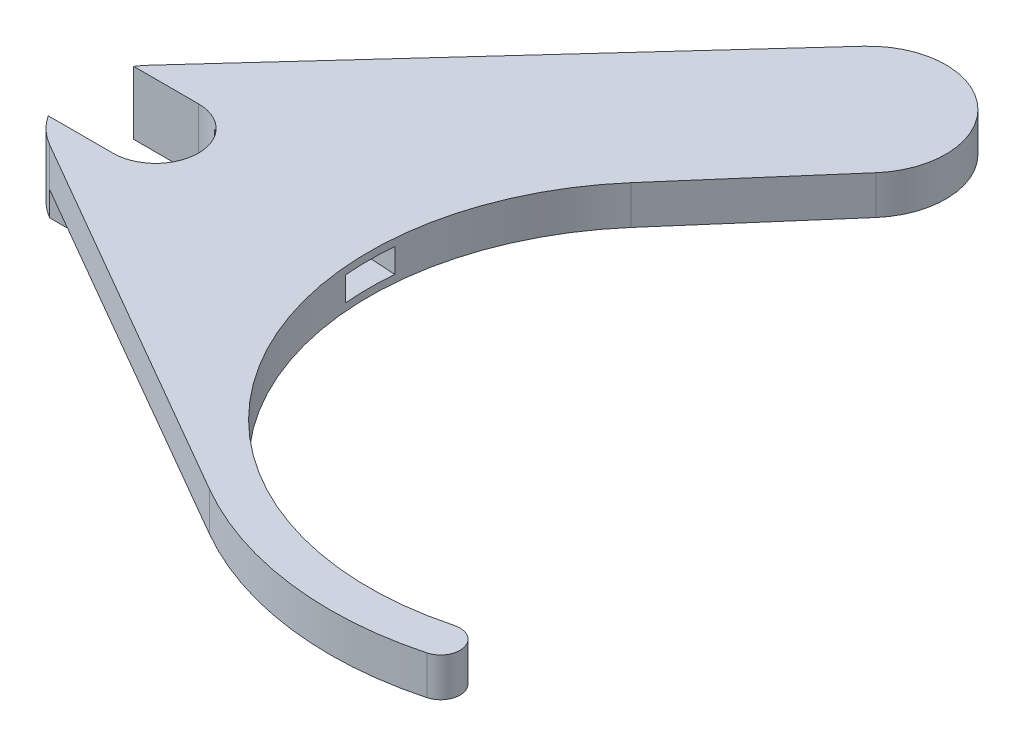
ISO-10303-21;
HEADER;
FILE_DESCRIPTION(('STEP AP214'),'2;1');
FILE_NAME('part.step','',(''),(''),'','','');
FILE_SCHEMA(('AUTOMOTIVE_DESIGN { 1 0 10303 214 1 1 1 1 }'));
ENDSEC;
DATA;
#1=APPLICATION_CONTEXT('core data for automotive mechanical design processes');
#2=APPLICATION_PROTOCOL_DEFINITION('international standard','automotive_design',2000,#1);
#3=PRODUCT_CONTEXT('',#1,'mechanical');
#4=PRODUCT('Part','Part','',(#3));
#5=PRODUCT_RELATED_PRODUCT_CATEGORY('part','',(#4));
#6=PRODUCT_DEFINITION_FORMATION('','',#4);
#7=PRODUCT_DEFINITION_CONTEXT('part definition',#1,'design');
#8=PRODUCT_DEFINITION('design','',#6,#7);
#9=PRODUCT_DEFINITION_SHAPE('','',#8);
#10=(LENGTH_UNIT() NAMED_UNIT(*) SI_UNIT(.MILLI.,.METRE.));
#11=(NAMED_UNIT(*) PLANE_ANGLE_UNIT() SI_UNIT($,.RADIAN.));
#12=(NAMED_UNIT(*) SI_UNIT($,.STERADIAN.) SOLID_ANGLE_UNIT());
#13=UNCERTAINTY_MEASURE_WITH_UNIT(LENGTH_MEASURE(1.E-05),#10,'distance_accuracy_value','');
#14=(GEOMETRIC_REPRESENTATION_CONTEXT(3) GLOBAL_UNCERTAINTY_ASSIGNED_CONTEXT((#13)) GLOBAL_UNIT_ASSIGNED_CONTEXT((#10,
#11,#12)) REPRESENTATION_CONTEXT('',''));
#15=CARTESIAN_POINT('',(0.,0.,0.));
#16=DIRECTION('',(0.,0.,1.));
#17=DIRECTION('',(1.,0.,0.));
#18=AXIS2_PLACEMENT_3D('',#15,#16,#17);
#19=CARTESIAN_POINT('',(0.,4.7625,0.));
#20=DIRECTION('',(0.,-1.,0.));
#21=DIRECTION('',(0.,0.,-1.));
#22=AXIS2_PLACEMENT_3D('',#19,#20,#21);
#23=CYLINDRICAL_SURFACE('',#22,6.35);
#24=CARTESIAN_POINT('',(0.,3.96875,0.));
#25=DIRECTION('',(0.,-1.,0.));
#26=DIRECTION('',(0.,0.,-1.));
#27=AXIS2_PLACEMENT_3D('',#24,#25,#26);
#28=CIRCLE('',#27,6.35);
#29=CARTESIAN_POINT('',(-3.175,3.96875,5.49926131403119));
#30=VERTEX_POINT('',#29);
#31=CARTESIAN_POINT('',(-5.29834503406182,3.96875,3.5000057));
#32=VERTEX_POINT('',#31);
#33=EDGE_CURVE('E185',#30,#32,#28,.T.);
#34=ORIENTED_EDGE('',*,*,#33,.T.);
#35=DIRECTION('',(0.,-1.,0.));
#36=VECTOR('',#35,1.);
#37=CARTESIAN_POINT('',(-5.29834503406182,16.8464882443737,3.5000057));
#38=LINE('',#37,#36);
#39=CARTESIAN_POINT('',(-5.29834503406182,-1.20625,3.5000057));
#40=VERTEX_POINT('',#39);
#41=EDGE_CURVE('E180',#32,#40,#38,.T.);
#42=ORIENTED_EDGE('',*,*,#41,.T.);
#43=CARTESIAN_POINT('',(0.,-1.20625,0.));
#44=DIRECTION('',(0.,-1.,0.));
#45=DIRECTION('',(1.,0.,0.));
#46=AXIS2_PLACEMENT_3D('',#43,#44,#45);
#47=CIRCLE('',#46,6.35);
#48=CARTESIAN_POINT('',(-3.175,-1.20625,5.49926131403119));
#49=VERTEX_POINT('',#48);
#50=EDGE_CURVE('E184',#49,#40,#47,.T.);
#51=ORIENTED_EDGE('',*,*,#50,.F.);
#52=DIRECTION('',(0.,-1.,0.));
#53=VECTOR('',#52,1.);
#54=CARTESIAN_POINT('',(-3.175,4.7625,5.49926131403118));
#55=LINE('',#54,#53);
#56=EDGE_CURVE('E383',#30,#49,#55,.T.);
#57=ORIENTED_EDGE('',*,*,#56,.F.);
#58=EDGE_LOOP('',(#34,#42,#51,#57));
#59=FACE_BOUND('',#58,.T.);
#60=ADVANCED_FACE('F43',(#59),#23,.T.);
#61=CARTESIAN_POINT('',(41.275,4.7625,0.));
#62=DIRECTION('',(0.,-1.,0.));
#63=DIRECTION('',(0.,0.,-1.));
#64=AXIS2_PLACEMENT_3D('',#61,#62,#63);
#65=CYLINDRICAL_SURFACE('',#64,23.8125);
#66=CARTESIAN_POINT('',(41.275,3.96875,0.));
#67=DIRECTION('',(0.,-1.,0.));
#68=DIRECTION('',(0.,0.,-1.));
#69=AXIS2_PLACEMENT_3D('',#66,#67,#68);
#70=CIRCLE('',#69,23.8125);
#71=CARTESIAN_POINT('',(47.4381285115036,3.96875,23.0011087385085));
#72=VERTEX_POINT('',#71);
#73=CARTESIAN_POINT('',(23.2959529005196,3.96875,-15.6137446387683));
#74=VERTEX_POINT('',#73);
#75=EDGE_CURVE('E296',#72,#74,#70,.T.);
#76=ORIENTED_EDGE('',*,*,#75,.F.);
#77=DIRECTION('',(0.,-1.,0.));
#78=VECTOR('',#77,1.);
#79=CARTESIAN_POINT('',(47.4381285115036,4.7625,23.0011087385085));
#80=LINE('',#79,#78);
#81=CARTESIAN_POINT('',(47.4381285115036,0.79375,23.0011087385085));
#82=VERTEX_POINT('',#81);
#83=EDGE_CURVE('E371',#72,#82,#80,.T.);
#84=ORIENTED_EDGE('',*,*,#83,.T.);
#85=CARTESIAN_POINT('',(41.275,0.79375,0.));
#86=DIRECTION('',(0.,-1.,0.));
#87=DIRECTION('',(1.,0.,0.));
#88=AXIS2_PLACEMENT_3D('',#85,#86,#87);
#89=CIRCLE('',#88,23.8125);
#90=CARTESIAN_POINT('',(23.2959529005196,0.79375,-15.6137446387683));
#91=VERTEX_POINT('',#90);
#92=EDGE_CURVE('E274',#82,#91,#89,.T.);
#93=ORIENTED_EDGE('',*,*,#92,.T.);
#94=DIRECTION('',(0.,-1.,0.));
#95=VECTOR('',#94,1.);
#96=CARTESIAN_POINT('',(23.2959529005196,4.7625,-15.6137446387683));
#97=LINE('',#96,#95);
#98=EDGE_CURVE('E367',#74,#91,#97,.T.);
#99=ORIENTED_EDGE('',*,*,#98,.F.);
#100=EDGE_LOOP('',(#76,#84,#93,#99));
#101=FACE_BOUND('',#100,.T.);
#102=DIRECTION('',(0.,-1.,0.));
#103=VECTOR('',#102,1.);
#104=CARTESIAN_POINT('',(17.5479858090224,4.7625,2.0159250559346));
#105=LINE('',#104,#103);
#106=CARTESIAN_POINT('',(17.5479858090223,1.39125,2.0159250559346));
#107=VERTEX_POINT('',#106);
#108=CARTESIAN_POINT('',(17.5479858090224,3.37125,2.0159250559346));
#109=VERTEX_POINT('',#108);
#110=EDGE_CURVE('E342',#107,#109,#105,.F.);
#111=ORIENTED_EDGE('',*,*,#110,.T.);
#112=CARTESIAN_POINT('',(41.275,3.37125,0.));
#113=DIRECTION('',(0.,-1.,0.));
#114=DIRECTION('',(0.,0.,-1.));
#115=AXIS2_PLACEMENT_3D('',#112,#113,#114);
#116=CIRCLE('',#115,23.8125);
#117=CARTESIAN_POINT('',(17.5479858090224,3.37125,-2.0159250559346));
#118=VERTEX_POINT('',#117);
#119=EDGE_CURVE('E190',#109,#118,#116,.T.);
#120=ORIENTED_EDGE('',*,*,#119,.T.);
#121=DIRECTION('',(0.,-1.,0.));
#122=VECTOR('',#121,1.);
#123=CARTESIAN_POINT('',(17.5479858090224,4.7625,-2.0159250559346));
#124=LINE('',#123,#122);
#125=CARTESIAN_POINT('',(17.5479858090223,1.39125,-2.0159250559346));
#126=VERTEX_POINT('',#125);
#127=EDGE_CURVE('E338',#118,#126,#124,.T.);
#128=ORIENTED_EDGE('',*,*,#127,.T.);
#129=CARTESIAN_POINT('',(41.275,1.39125,0.));
#130=DIRECTION('',(0.,1.,0.));
#131=DIRECTION('',(0.,0.,1.));
#132=AXIS2_PLACEMENT_3D('',#129,#130,#131);
#133=CIRCLE('',#132,23.8125);
#134=EDGE_CURVE('E316',#126,#107,#133,.T.);
#135=ORIENTED_EDGE('',*,*,#134,.T.);
#136=EDGE_LOOP('',(#111,#120,#128,#135));
#137=FACE_BOUND('',#136,.T.);
#138=ADVANCED_FACE('F441',(#101,#137),#65,.F.);
#139=CARTESIAN_POINT('',(0.,16.8464882443737,0.));
#140=DIRECTION('',(0.,-1.,0.));
#141=DIRECTION('',(0.,0.,-1.));
#142=AXIS2_PLACEMENT_3D('',#139,#140,#141);
#143=CYLINDRICAL_SURFACE('',#142,3.5000057);
#144=DIRECTION('',(0.,-1.,0.));
#145=VECTOR('',#144,1.);
#146=CARTESIAN_POINT('',(0.,16.8464882443737,3.5000057));
#147=LINE('',#146,#145);
#148=CARTESIAN_POINT('',(0.,3.96875,3.5000057));
#149=VERTEX_POINT('',#148);
#150=CARTESIAN_POINT('',(0.,-1.20625,3.5000057));
#151=VERTEX_POINT('',#150);
#152=EDGE_CURVE('E195',#149,#151,#147,.T.);
#153=ORIENTED_EDGE('',*,*,#152,.F.);
#154=CARTESIAN_POINT('',(0.,3.96875,0.));
#155=DIRECTION('',(0.,-1.,0.));
#156=DIRECTION('',(0.,0.,-1.));
#157=AXIS2_PLACEMENT_3D('',#154,#155,#156);
#158=CIRCLE('',#157,3.5000057);
#159=CARTESIAN_POINT('',(0.,3.96875,-3.5000057));
#160=VERTEX_POINT('',#159);
#161=EDGE_CURVE('E52',#160,#149,#158,.T.);
#162=ORIENTED_EDGE('',*,*,#161,.F.);
#163=DIRECTION('',(0.,-1.,0.));
#164=VECTOR('',#163,1.);
#165=CARTESIAN_POINT('',(0.,16.8464882443737,-3.5000057));
#166=LINE('',#165,#164);
#167=CARTESIAN_POINT('',(0.,-1.20625,-3.5000057));
#168=VERTEX_POINT('',#167);
#169=EDGE_CURVE('E349',#160,#168,#166,.T.);
#170=ORIENTED_EDGE('',*,*,#169,.T.);
#171=CARTESIAN_POINT('',(0.,-1.20625,0.));
#172=DIRECTION('',(0.,1.,0.));
#173=DIRECTION('',(1.,0.,0.));
#174=AXIS2_PLACEMENT_3D('',#171,#172,#173);
#175=CIRCLE('',#174,3.5000057);
#176=EDGE_CURVE('E200',#151,#168,#175,.T.);
#177=ORIENTED_EDGE('',*,*,#176,.F.);
#178=EDGE_LOOP('',(#153,#162,#170,#177));
#179=FACE_BOUND('',#178,.T.);
#180=CARTESIAN_POINT('',(0.,3.37125,0.));
#181=DIRECTION('',(0.,-1.,0.));
#182=DIRECTION('',(0.,0.,-1.));
#183=AXIS2_PLACEMENT_3D('',#180,#181,#182);
#184=CIRCLE('',#183,3.5000057);
#185=CARTESIAN_POINT('',(1.80278670397595,3.37125,-3.));
#186=VERTEX_POINT('',#185);
#187=CARTESIAN_POINT('',(1.80278670397595,3.37125,3.));
#188=VERTEX_POINT('',#187);
#189=EDGE_CURVE('E256',#186,#188,#184,.T.);
#190=ORIENTED_EDGE('',*,*,#189,.T.);
#191=DIRECTION('',(0.,1.,0.));
#192=VECTOR('',#191,1.);
#193=CARTESIAN_POINT('',(1.80278670397595,-17.0880074906351,3.));
#194=LINE('',#193,#192);
#195=CARTESIAN_POINT('',(1.80278670397595,1.39125,3.));
#196=VERTEX_POINT('',#195);
#197=EDGE_CURVE('E328',#196,#188,#194,.T.);
#198=ORIENTED_EDGE('',*,*,#197,.F.);
#199=CARTESIAN_POINT('',(0.,1.39125,0.));
#200=DIRECTION('',(0.,1.,0.));
#201=DIRECTION('',(0.,0.,1.));
#202=AXIS2_PLACEMENT_3D('',#199,#200,#201);
#203=CIRCLE('',#202,3.5000057);
#204=CARTESIAN_POINT('',(1.80278670397595,1.39125,-3.));
#205=VERTEX_POINT('',#204);
#206=EDGE_CURVE('E312',#205,#196,#203,.F.);
#207=ORIENTED_EDGE('',*,*,#206,.F.);
#208=DIRECTION('',(0.,1.,0.));
#209=VECTOR('',#208,1.);
#210=CARTESIAN_POINT('',(1.80278670397595,-17.0880074906351,-3.));
#211=LINE('',#210,#209);
#212=EDGE_CURVE('E324',#205,#186,#211,.T.);
#213=ORIENTED_EDGE('',*,*,#212,.T.);
#214=EDGE_LOOP('',(#190,#198,#207,#213));
#215=FACE_BOUND('',#214,.T.);
#216=ADVANCED_FACE('F401',(#179,#215),#143,.F.);
#217=DIRECTION('',(0.,-1.,0.));
#218=VECTOR('',#217,1.);
#219=CARTESIAN_POINT('',(-5.29834503406182,16.8464882443737,-3.5000057));
#220=LINE('',#219,#218);
#221=CARTESIAN_POINT('',(-5.29834503406182,3.96875,-3.5000057));
#222=VERTEX_POINT('',#221);
#223=CARTESIAN_POINT('',(-5.29834503406182,-1.20625,-3.5000057));
#224=VERTEX_POINT('',#223);
#225=EDGE_CURVE('E189',#222,#224,#220,.T.);
#226=ORIENTED_EDGE('',*,*,#225,.F.);
#227=CARTESIAN_POINT('',(-4.69200650335417,3.96875,-4.27873520710059));
#228=VERTEX_POINT('',#227);
#229=EDGE_CURVE('E293',#222,#228,#28,.T.);
#230=ORIENTED_EDGE('',*,*,#229,.T.);
#231=DIRECTION('',(0.,-1.,0.));
#232=VECTOR('',#231,1.);
#233=CARTESIAN_POINT('',(-4.69200650335417,4.7625,-4.27873520710059));
#234=LINE('',#233,#232);
#235=CARTESIAN_POINT('',(-4.69200650335417,-1.20625,-4.27873520710059));
#236=VERTEX_POINT('',#235);
#237=EDGE_CURVE('E356',#228,#236,#234,.T.);
#238=ORIENTED_EDGE('',*,*,#237,.T.);
#239=CARTESIAN_POINT('',(0.,-1.20625,0.));
#240=DIRECTION('',(0.,-1.,0.));
#241=DIRECTION('',(1.,0.,0.));
#242=AXIS2_PLACEMENT_3D('',#239,#240,#241);
#243=CIRCLE('',#242,6.35);
#244=EDGE_CURVE('E218',#224,#236,#243,.T.);
#245=ORIENTED_EDGE('',*,*,#244,.F.);
#246=EDGE_LOOP('',(#226,#230,#238,#245));
#247=FACE_BOUND('',#246,.T.);
#248=ADVANCED_FACE('F45',(#247),#23,.T.);
#249=CARTESIAN_POINT('',(-3.175,4.7625,5.49926131403118));
#250=DIRECTION('',(0.5,0.,-0.866025403784439));
#251=DIRECTION('',(-0.866025403784438,0.,-0.5));
#252=AXIS2_PLACEMENT_3D('',#249,#250,#251);
#253=PLANE('',#252);
#254=DIRECTION('',(0.,-1.,0.));
#255=VECTOR('',#254,1.);
#256=CARTESIAN_POINT('',(27.78125,4.7625,23.3718605846325));
#257=LINE('',#256,#255);
#258=CARTESIAN_POINT('',(27.78125,3.96875,23.3718605846326));
#259=VERTEX_POINT('',#258);
#260=CARTESIAN_POINT('',(27.78125,0.79375,23.3718605846326));
#261=VERTEX_POINT('',#260);
#262=EDGE_CURVE('E379',#259,#261,#257,.T.);
#263=ORIENTED_EDGE('',*,*,#262,.F.);
#264=DIRECTION('',(0.866025403784439,0.,0.5));
#265=VECTOR('',#264,1.);
#266=CARTESIAN_POINT('',(-3.175,3.96875,5.49926131403118));
#267=LINE('',#266,#265);
#268=EDGE_CURVE('E260',#30,#259,#267,.T.);
#269=ORIENTED_EDGE('',*,*,#268,.F.);
#270=ORIENTED_EDGE('',*,*,#56,.T.);
#271=DIRECTION('',(-0.866025403784325,0.,-0.500000000000198));
#272=VECTOR('',#271,1.);
#273=CARTESIAN_POINT('',(-3.175,-1.20625,5.49926131403119));
#274=LINE('',#273,#272);
#275=CARTESIAN_POINT('',(-3.17371068568157,-1.20625,5.5000057));
#276=VERTEX_POINT('',#275);
#277=EDGE_CURVE('E205',#276,#49,#274,.T.);
#278=ORIENTED_EDGE('',*,*,#277,.F.);
#279=DIRECTION('',(0.,1.,0.));
#280=VECTOR('',#279,1.);
#281=CARTESIAN_POINT('',(-3.17371068568157,-1.20625,5.5000057));
#282=LINE('',#281,#280);
#283=CARTESIAN_POINT('',(-3.17371068568157,0.79375,5.5000057));
#284=VERTEX_POINT('',#283);
#285=EDGE_CURVE('E236',#276,#284,#282,.T.);
#286=ORIENTED_EDGE('',*,*,#285,.T.);
#287=DIRECTION('',(0.866025403784439,0.,0.5));
#288=VECTOR('',#287,1.);
#289=CARTESIAN_POINT('',(-3.175,0.79375,5.49926131403118));
#290=LINE('',#289,#288);
#291=EDGE_CURVE('E259',#284,#261,#290,.T.);
#292=ORIENTED_EDGE('',*,*,#291,.T.);
#293=EDGE_LOOP('',(#263,#269,#270,#278,#286,#292));
#294=FACE_BOUND('',#293,.T.);
#295=ADVANCED_FACE('F428',(#294),#253,.F.);
#296=CARTESIAN_POINT('',(41.275,4.7625,0.));
#297=DIRECTION('',(0.,-1.,0.));
#298=DIRECTION('',(0.,0.,-1.));
#299=AXIS2_PLACEMENT_3D('',#296,#297,#298);
#300=CYLINDRICAL_SURFACE('',#299,26.9875);
#301=DIRECTION('',(0.,-1.,0.));
#302=VECTOR('',#301,1.);
#303=CARTESIAN_POINT('',(48.2598789797041,4.7625,26.0679232369763));
#304=LINE('',#303,#302);
#305=CARTESIAN_POINT('',(48.2598789797041,3.96875,26.0679232369763));
#306=VERTEX_POINT('',#305);
#307=CARTESIAN_POINT('',(48.2598789797041,0.79375,26.0679232369763));
#308=VERTEX_POINT('',#307);
#309=EDGE_CURVE('E375',#306,#308,#304,.T.);
#310=ORIENTED_EDGE('',*,*,#309,.F.);
#311=CARTESIAN_POINT('',(41.275,3.96875,0.));
#312=DIRECTION('',(0.,-1.,0.));
#313=DIRECTION('',(0.,0.,-1.));
#314=AXIS2_PLACEMENT_3D('',#311,#312,#313);
#315=CIRCLE('',#314,26.9875);
#316=EDGE_CURVE('E303',#306,#259,#315,.T.);
#317=ORIENTED_EDGE('',*,*,#316,.T.);
#318=ORIENTED_EDGE('',*,*,#262,.T.);
#319=CARTESIAN_POINT('',(41.275,0.79375,0.));
#320=DIRECTION('',(0.,-1.,0.));
#321=DIRECTION('',(1.,0.,0.));
#322=AXIS2_PLACEMENT_3D('',#319,#320,#321);
#323=CIRCLE('',#322,26.9875);
#324=EDGE_CURVE('E281',#308,#261,#323,.T.);
#325=ORIENTED_EDGE('',*,*,#324,.F.);
#326=EDGE_LOOP('',(#310,#317,#318,#325));
#327=FACE_BOUND('',#326,.T.);
#328=ADVANCED_FACE('F432',(#327),#300,.T.);
#329=CARTESIAN_POINT('',(47.8490037456039,4.7625,24.5345159877424));
#330=DIRECTION('',(0.,-1.,0.));
#331=DIRECTION('',(0.,0.,-1.));
#332=AXIS2_PLACEMENT_3D('',#329,#330,#331);
#333=CYLINDRICAL_SURFACE('',#332,1.58750000000001);
#334=ORIENTED_EDGE('',*,*,#83,.F.);
#335=CARTESIAN_POINT('',(47.8490037456039,3.96875,24.5345159877424));
#336=DIRECTION('',(0.,-1.,0.));
#337=DIRECTION('',(0.,0.,-1.));
#338=AXIS2_PLACEMENT_3D('',#335,#336,#337);
#339=CIRCLE('',#338,1.58750000000001);
#340=EDGE_CURVE('E299',#72,#306,#339,.T.);
#341=ORIENTED_EDGE('',*,*,#340,.T.);
#342=ORIENTED_EDGE('',*,*,#309,.T.);
#343=CARTESIAN_POINT('',(47.8490037456039,0.79375,24.5345159877424));
#344=DIRECTION('',(0.,-1.,0.));
#345=DIRECTION('',(1.,0.,0.));
#346=AXIS2_PLACEMENT_3D('',#343,#344,#345);
#347=CIRCLE('',#346,1.58750000000001);
#348=EDGE_CURVE('E278',#82,#308,#347,.T.);
#349=ORIENTED_EDGE('',*,*,#348,.F.);
#350=EDGE_LOOP('',(#334,#341,#342,#349));
#351=FACE_BOUND('',#350,.T.);
#352=ADVANCED_FACE('F436',(#351),#333,.T.);
#353=CARTESIAN_POINT('',(5.55033032760959,4.7625,4.82013534513805));
#354=DIRECTION('',(-0.75502559997818,0.,-0.655695312914153));
#355=DIRECTION('',(-0.655695312914153,0.,0.75502559997818));
#356=AXIS2_PLACEMENT_3D('',#353,#354,#355);
#357=PLANE('',#356);
#358=DIRECTION('',(0.,-1.,0.));
#359=VECTOR('',#358,1.);
#360=CARTESIAN_POINT('',(32.6061914060153,4.7625,-26.3343770347972));
#361=LINE('',#360,#359);
#362=CARTESIAN_POINT('',(32.6061914060153,3.96875,-26.3343770347972));
#363=VERTEX_POINT('',#362);
#364=CARTESIAN_POINT('',(32.6061914060153,0.79375,-26.3343770347972));
#365=VERTEX_POINT('',#364);
#366=EDGE_CURVE('E363',#363,#365,#361,.T.);
#367=ORIENTED_EDGE('',*,*,#366,.F.);
#368=DIRECTION('',(-0.655695312914153,0.,0.75502559997818));
#369=VECTOR('',#368,1.);
#370=CARTESIAN_POINT('',(5.55033032760959,3.96875,4.82013534513805));
#371=LINE('',#370,#369);
#372=EDGE_CURVE('E289',#363,#74,#371,.T.);
#373=ORIENTED_EDGE('',*,*,#372,.T.);
#374=ORIENTED_EDGE('',*,*,#98,.T.);
#375=DIRECTION('',(-0.655695312914153,0.,0.75502559997818));
#376=VECTOR('',#375,1.);
#377=CARTESIAN_POINT('',(5.55033032760959,0.79375,4.82013534513805));
#378=LINE('',#377,#376);
#379=EDGE_CURVE('E271',#365,#91,#378,.T.);
#380=ORIENTED_EDGE('',*,*,#379,.F.);
#381=EDGE_LOOP('',(#367,#373,#374,#380));
#382=FACE_BOUND('',#381,.T.);
#383=ADVANCED_FACE('F446',(#382),#357,.F.);
#384=CARTESIAN_POINT('',(27.8117788461538,4.7625,-30.4980422718021));
#385=DIRECTION('',(0.,-1.,0.));
#386=DIRECTION('',(0.,0.,-1.));
#387=AXIS2_PLACEMENT_3D('',#384,#385,#386);
#388=CYLINDRICAL_SURFACE('',#387,6.35000000000001);
#389=DIRECTION('',(0.,-1.,0.));
#390=VECTOR('',#389,1.);
#391=CARTESIAN_POINT('',(23.1197723427997,4.7625,-34.7767774789027));
#392=LINE('',#391,#390);
#393=CARTESIAN_POINT('',(23.1197723427997,3.96875,-34.7767774789027));
#394=VERTEX_POINT('',#393);
#395=CARTESIAN_POINT('',(23.1197723427997,0.79375,-34.7767774789027));
#396=VERTEX_POINT('',#395);
#397=EDGE_CURVE('E359',#394,#396,#392,.T.);
#398=ORIENTED_EDGE('',*,*,#397,.F.);
#399=CARTESIAN_POINT('',(27.8117788461538,3.96875,-30.4980422718021));
#400=DIRECTION('',(0.,-1.,0.));
#401=DIRECTION('',(0.,0.,-1.));
#402=AXIS2_PLACEMENT_3D('',#399,#400,#401);
#403=CIRCLE('',#402,6.35000000000001);
#404=EDGE_CURVE('E285',#394,#363,#403,.T.);
#405=ORIENTED_EDGE('',*,*,#404,.T.);
#406=ORIENTED_EDGE('',*,*,#366,.T.);
#407=CARTESIAN_POINT('',(27.8117788461538,0.79375,-30.4980422718021));
#408=DIRECTION('',(0.,-1.,0.));
#409=DIRECTION('',(1.,0.,0.));
#410=AXIS2_PLACEMENT_3D('',#407,#408,#409);
#411=CIRCLE('',#410,6.35000000000001);
#412=EDGE_CURVE('E268',#396,#365,#411,.T.);
#413=ORIENTED_EDGE('',*,*,#412,.F.);
#414=EDGE_LOOP('',(#398,#405,#406,#413));
#415=FACE_BOUND('',#414,.T.);
#416=ADVANCED_FACE('F449',(#415),#388,.T.);
#417=CARTESIAN_POINT('',(-4.69200650335417,4.7625,-4.27873520710059));
#418=DIRECTION('',(-0.738898661945539,0.,-0.673816568047337));
#419=DIRECTION('',(-0.673816568047337,0.,0.738898661945539));
#420=AXIS2_PLACEMENT_3D('',#417,#418,#419);
#421=PLANE('',#420);
#422=DIRECTION('',(-0.673816568047337,0.,0.738898661945539));
#423=VECTOR('',#422,1.);
#424=CARTESIAN_POINT('',(-4.69200650335417,3.96875,-4.27873520710059));
#425=LINE('',#424,#423);
#426=EDGE_CURVE('E386',#394,#228,#425,.T.);
#427=ORIENTED_EDGE('',*,*,#426,.F.);
#428=ORIENTED_EDGE('',*,*,#397,.T.);
#429=DIRECTION('',(-0.673816568047337,0.,0.738898661945539));
#430=VECTOR('',#429,1.);
#431=CARTESIAN_POINT('',(-4.69200650335417,0.79375,-4.27873520710059));
#432=LINE('',#431,#430);
#433=CARTESIAN_POINT('',(-3.57830534978026,0.79375,-5.50000570000001));
#434=VERTEX_POINT('',#433);
#435=EDGE_CURVE('E263',#396,#434,#432,.T.);
#436=ORIENTED_EDGE('',*,*,#435,.T.);
#437=DIRECTION('',(0.,1.,0.));
#438=VECTOR('',#437,1.);
#439=CARTESIAN_POINT('',(-3.57830534978026,-1.20625,-5.50000570000001));
#440=LINE('',#439,#438);
#441=CARTESIAN_POINT('',(-3.57830534978026,-1.20625,-5.50000570000001));
#442=VERTEX_POINT('',#441);
#443=EDGE_CURVE('E252',#442,#434,#440,.T.);
#444=ORIENTED_EDGE('',*,*,#443,.F.);
#445=DIRECTION('',(0.67381656804734,0.,-0.738898661945537));
#446=VECTOR('',#445,1.);
#447=CARTESIAN_POINT('',(-3.57830534978026,-1.20625,-5.50000570000001));
#448=LINE('',#447,#446);
#449=EDGE_CURVE('E222',#236,#442,#448,.T.);
#450=ORIENTED_EDGE('',*,*,#449,.F.);
#451=ORIENTED_EDGE('',*,*,#237,.F.);
#452=EDGE_LOOP('',(#427,#428,#436,#444,#450,#451));
#453=FACE_BOUND('',#452,.T.);
#454=ADVANCED_FACE('F413',(#453),#421,.T.);
#455=CARTESIAN_POINT('',(0.,16.8464882443737,3.5000057));
#456=DIRECTION('',(0.,0.,1.));
#457=DIRECTION('',(1.,0.,0.));
#458=AXIS2_PLACEMENT_3D('',#455,#456,#457);
#459=PLANE('',#458);
#460=ORIENTED_EDGE('',*,*,#152,.T.);
#461=DIRECTION('',(1.,0.,0.));
#462=VECTOR('',#461,1.);
#463=CARTESIAN_POINT('',(-5.29834503406182,-1.20625,3.5000057));
#464=LINE('',#463,#462);
#465=EDGE_CURVE('E193',#40,#151,#464,.T.);
#466=ORIENTED_EDGE('',*,*,#465,.F.);
#467=ORIENTED_EDGE('',*,*,#41,.F.);
#468=DIRECTION('',(-1.,0.,0.));
#469=VECTOR('',#468,1.);
#470=CARTESIAN_POINT('',(28.3147962799528,3.96875,3.5000057));
#471=LINE('',#470,#469);
#472=EDGE_CURVE('E12',#149,#32,#471,.T.);
#473=ORIENTED_EDGE('',*,*,#472,.F.);
#474=EDGE_LOOP('',(#460,#466,#467,#473));
#475=FACE_BOUND('',#474,.T.);
#476=ADVANCED_FACE('F194',(#475),#459,.F.);
#477=CARTESIAN_POINT('',(0.,16.8464882443737,-3.5000057));
#478=DIRECTION('',(0.,0.,1.));
#479=DIRECTION('',(1.,0.,0.));
#480=AXIS2_PLACEMENT_3D('',#477,#478,#479);
#481=PLANE('',#480);
#482=ORIENTED_EDGE('',*,*,#225,.T.);
#483=DIRECTION('',(-1.,0.,0.));
#484=VECTOR('',#483,1.);
#485=CARTESIAN_POINT('',(-5.29834503406182,-1.20625,-3.5000057));
#486=LINE('',#485,#484);
#487=EDGE_CURVE('E214',#168,#224,#486,.T.);
#488=ORIENTED_EDGE('',*,*,#487,.F.);
#489=ORIENTED_EDGE('',*,*,#169,.F.);
#490=DIRECTION('',(1.,0.,0.));
#491=VECTOR('',#490,1.);
#492=CARTESIAN_POINT('',(28.3147962799527,3.96875,-3.5000057));
#493=LINE('',#492,#491);
#494=EDGE_CURVE('E390',#222,#160,#493,.T.);
#495=ORIENTED_EDGE('',*,*,#494,.F.);
#496=EDGE_LOOP('',(#482,#488,#489,#495));
#497=FACE_BOUND('',#496,.T.);
#498=ADVANCED_FACE('F406',(#497),#481,.T.);
#499=CARTESIAN_POINT('',(0.,3.37125,0.));
#500=DIRECTION('',(0.,1.,0.));
#501=DIRECTION('',(0.,0.,1.));
#502=AXIS2_PLACEMENT_3D('',#499,#500,#501);
#503=PLANE('',#502);
#504=DIRECTION('',(-0.998052578482889,0.,0.0623782861551805));
#505=VECTOR('',#504,1.);
#506=CARTESIAN_POINT('',(17.802786703976,3.37125,2.));
#507=LINE('',#506,#505);
#508=EDGE_CURVE('E320',#109,#188,#507,.T.);
#509=ORIENTED_EDGE('',*,*,#508,.T.);
#510=ORIENTED_EDGE('',*,*,#189,.F.);
#511=DIRECTION('',(0.998052578482889,0.,0.0623782861551805));
#512=VECTOR('',#511,1.);
#513=CARTESIAN_POINT('',(1.80278670397595,3.37125,-3.));
#514=LINE('',#513,#512);
#515=EDGE_CURVE('E307',#186,#118,#514,.T.);
#516=ORIENTED_EDGE('',*,*,#515,.T.);
#517=ORIENTED_EDGE('',*,*,#119,.F.);
#518=EDGE_LOOP('',(#509,#510,#516,#517));
#519=FACE_BOUND('',#518,.T.);
#520=ADVANCED_FACE('F484',(#519),#503,.F.);
#521=CARTESIAN_POINT('',(17.802786703976,-17.0880074906351,2.));
#522=DIRECTION('',(-0.0623782861551805,0.,-0.998052578482889));
#523=DIRECTION('',(-0.998052578482889,0.,0.0623782861551805));
#524=AXIS2_PLACEMENT_3D('',#521,#522,#523);
#525=PLANE('',#524);
#526=DIRECTION('',(0.998052578482889,0.,-0.0623782861551805));
#527=VECTOR('',#526,1.);
#528=CARTESIAN_POINT('',(17.802786703976,1.39125,2.));
#529=LINE('',#528,#527);
#530=EDGE_CURVE('E308',#196,#107,#529,.T.);
#531=ORIENTED_EDGE('',*,*,#530,.F.);
#532=ORIENTED_EDGE('',*,*,#197,.T.);
#533=ORIENTED_EDGE('',*,*,#508,.F.);
#534=ORIENTED_EDGE('',*,*,#110,.F.);
#535=EDGE_LOOP('',(#531,#532,#533,#534));
#536=FACE_BOUND('',#535,.T.);
#537=ADVANCED_FACE('F489',(#536),#525,.T.);
#538=CARTESIAN_POINT('',(1.80278670397595,-17.0880074906351,-3.));
#539=DIRECTION('',(-0.0623782861551805,0.,0.998052578482889));
#540=DIRECTION('',(0.998052578482889,0.,0.0623782861551805));
#541=AXIS2_PLACEMENT_3D('',#538,#539,#540);
#542=PLANE('',#541);
#543=ORIENTED_EDGE('',*,*,#515,.F.);
#544=ORIENTED_EDGE('',*,*,#212,.F.);
#545=DIRECTION('',(-0.998052578482889,0.,-0.0623782861551805));
#546=VECTOR('',#545,1.);
#547=CARTESIAN_POINT('',(1.80278670397595,1.39125,-3.));
#548=LINE('',#547,#546);
#549=EDGE_CURVE('E311',#126,#205,#548,.T.);
#550=ORIENTED_EDGE('',*,*,#549,.F.);
#551=ORIENTED_EDGE('',*,*,#127,.F.);
#552=EDGE_LOOP('',(#543,#544,#550,#551));
#553=FACE_BOUND('',#552,.T.);
#554=ADVANCED_FACE('F463',(#553),#542,.T.);
#555=CARTESIAN_POINT('',(0.,1.39125,0.));
#556=DIRECTION('',(0.,1.,0.));
#557=DIRECTION('',(0.,0.,1.));
#558=AXIS2_PLACEMENT_3D('',#555,#556,#557);
#559=PLANE('',#558);
#560=ORIENTED_EDGE('',*,*,#549,.T.);
#561=ORIENTED_EDGE('',*,*,#206,.T.);
#562=ORIENTED_EDGE('',*,*,#530,.T.);
#563=ORIENTED_EDGE('',*,*,#134,.F.);
#564=EDGE_LOOP('',(#560,#561,#562,#563));
#565=FACE_BOUND('',#564,.T.);
#566=ADVANCED_FACE('F454',(#565),#559,.T.);
#567=CARTESIAN_POINT('',(28.3147962799527,0.79375,-49.0426657628404));
#568=DIRECTION('',(0.,-1.,0.));
#569=DIRECTION('',(1.,0.,0.));
#570=AXIS2_PLACEMENT_3D('',#567,#568,#569);
#571=PLANE('',#570);
#572=DIRECTION('',(-1.,0.,0.));
#573=VECTOR('',#572,1.);
#574=CARTESIAN_POINT('',(-3.17371068568157,0.79375,5.5000057));
#575=LINE('',#574,#573);
#576=CARTESIAN_POINT('',(0.,0.79375,5.5000057));
#577=VERTEX_POINT('',#576);
#578=EDGE_CURVE('E59',#577,#284,#575,.T.);
#579=ORIENTED_EDGE('',*,*,#578,.F.);
#580=CARTESIAN_POINT('',(0.,0.79375,0.));
#581=DIRECTION('',(0.,-1.,0.));
#582=DIRECTION('',(1.,0.,0.));
#583=AXIS2_PLACEMENT_3D('',#580,#581,#582);
#584=CIRCLE('',#583,5.5000057);
#585=CARTESIAN_POINT('',(0.,0.79375,-5.5000057));
#586=VERTEX_POINT('',#585);
#587=EDGE_CURVE('E209',#586,#577,#584,.T.);
#588=ORIENTED_EDGE('',*,*,#587,.F.);
#589=DIRECTION('',(1.,0.,0.));
#590=VECTOR('',#589,1.);
#591=CARTESIAN_POINT('',(-3.57830534978026,0.79375,-5.50000570000001));
#592=LINE('',#591,#590);
#593=EDGE_CURVE('E65',#434,#586,#592,.T.);
#594=ORIENTED_EDGE('',*,*,#593,.F.);
#595=ORIENTED_EDGE('',*,*,#435,.F.);
#596=ORIENTED_EDGE('',*,*,#412,.T.);
#597=ORIENTED_EDGE('',*,*,#379,.T.);
#598=ORIENTED_EDGE('',*,*,#92,.F.);
#599=ORIENTED_EDGE('',*,*,#348,.T.);
#600=ORIENTED_EDGE('',*,*,#324,.T.);
#601=ORIENTED_EDGE('',*,*,#291,.F.);
#602=EDGE_LOOP('',(#579,#588,#594,#595,#596,#597,#598,#599,#600,#601));
#603=FACE_BOUND('',#602,.T.);
#604=ADVANCED_FACE('F452',(#603),#571,.T.);
#605=CARTESIAN_POINT('',(28.3147962799527,3.96875,-49.0426657628404));
#606=DIRECTION('',(0.,-1.,0.));
#607=DIRECTION('',(0.,0.,-1.));
#608=AXIS2_PLACEMENT_3D('',#605,#606,#607);
#609=PLANE('',#608);
#610=ORIENTED_EDGE('',*,*,#161,.T.);
#611=ORIENTED_EDGE('',*,*,#472,.T.);
#612=ORIENTED_EDGE('',*,*,#33,.F.);
#613=ORIENTED_EDGE('',*,*,#268,.T.);
#614=ORIENTED_EDGE('',*,*,#316,.F.);
#615=ORIENTED_EDGE('',*,*,#340,.F.);
#616=ORIENTED_EDGE('',*,*,#75,.T.);
#617=ORIENTED_EDGE('',*,*,#372,.F.);
#618=ORIENTED_EDGE('',*,*,#404,.F.);
#619=ORIENTED_EDGE('',*,*,#426,.T.);
#620=ORIENTED_EDGE('',*,*,#229,.F.);
#621=ORIENTED_EDGE('',*,*,#494,.T.);
#622=EDGE_LOOP('',(#610,#611,#612,#613,#614,#615,#616,#617,#618,#619,#620,#621));
#623=FACE_BOUND('',#622,.T.);
#624=ADVANCED_FACE('F397',(#623),#609,.F.);
#625=CARTESIAN_POINT('',(-3.57830534978026,-1.20625,-5.50000570000001));
#626=DIRECTION('',(0.,0.,1.));
#627=DIRECTION('',(1.,0.,0.));
#628=AXIS2_PLACEMENT_3D('',#625,#626,#627);
#629=PLANE('',#628);
#630=ORIENTED_EDGE('',*,*,#593,.T.);
#631=DIRECTION('',(0.,1.,0.));
#632=VECTOR('',#631,1.);
#633=CARTESIAN_POINT('',(0.,-1.20625,-5.5000057));
#634=LINE('',#633,#632);
#635=CARTESIAN_POINT('',(0.,-1.20625,-5.5000057));
#636=VERTEX_POINT('',#635);
#637=EDGE_CURVE('E248',#636,#586,#634,.T.);
#638=ORIENTED_EDGE('',*,*,#637,.F.);
#639=DIRECTION('',(1.,0.,0.));
#640=VECTOR('',#639,1.);
#641=CARTESIAN_POINT('',(-3.57830534978026,-1.20625,-5.50000570000001));
#642=LINE('',#641,#640);
#643=EDGE_CURVE('E225',#442,#636,#642,.T.);
#644=ORIENTED_EDGE('',*,*,#643,.F.);
#645=ORIENTED_EDGE('',*,*,#443,.T.);
#646=EDGE_LOOP('',(#630,#638,#644,#645));
#647=FACE_BOUND('',#646,.T.);
#648=ADVANCED_FACE('F417',(#647),#629,.F.);
#649=CARTESIAN_POINT('',(0.,-1.20625,0.));
#650=DIRECTION('',(0.,1.,0.));
#651=DIRECTION('',(-1.,0.,0.));
#652=AXIS2_PLACEMENT_3D('',#649,#650,#651);
#653=CYLINDRICAL_SURFACE('',#652,5.5000057);
#654=ORIENTED_EDGE('',*,*,#587,.T.);
#655=DIRECTION('',(0.,1.,0.));
#656=VECTOR('',#655,1.);
#657=CARTESIAN_POINT('',(0.,-1.20625,5.5000057));
#658=LINE('',#657,#656);
#659=CARTESIAN_POINT('',(0.,-1.20625,5.5000057));
#660=VERTEX_POINT('',#659);
#661=EDGE_CURVE('E244',#660,#577,#658,.T.);
#662=ORIENTED_EDGE('',*,*,#661,.F.);
#663=CARTESIAN_POINT('',(0.,-1.20625,0.));
#664=DIRECTION('',(0.,-1.,0.));
#665=DIRECTION('',(1.,0.,0.));
#666=AXIS2_PLACEMENT_3D('',#663,#664,#665);
#667=CIRCLE('',#666,5.5000057);
#668=EDGE_CURVE('E228',#636,#660,#667,.T.);
#669=ORIENTED_EDGE('',*,*,#668,.F.);
#670=ORIENTED_EDGE('',*,*,#637,.T.);
#671=EDGE_LOOP('',(#654,#662,#669,#670));
#672=FACE_BOUND('',#671,.T.);
#673=ADVANCED_FACE('F423',(#672),#653,.T.);
#674=CARTESIAN_POINT('',(-3.17371068568157,-1.20625,5.5000057));
#675=DIRECTION('',(0.,0.,-1.));
#676=DIRECTION('',(-1.,0.,0.));
#677=AXIS2_PLACEMENT_3D('',#674,#675,#676);
#678=PLANE('',#677);
#679=ORIENTED_EDGE('',*,*,#578,.T.);
#680=ORIENTED_EDGE('',*,*,#285,.F.);
#681=DIRECTION('',(-1.,0.,0.));
#682=VECTOR('',#681,1.);
#683=CARTESIAN_POINT('',(-3.17371068568157,-1.20625,5.5000057));
#684=LINE('',#683,#682);
#685=EDGE_CURVE('E231',#660,#276,#684,.T.);
#686=ORIENTED_EDGE('',*,*,#685,.F.);
#687=ORIENTED_EDGE('',*,*,#661,.T.);
#688=EDGE_LOOP('',(#679,#680,#686,#687));
#689=FACE_BOUND('',#688,.T.);
#690=ADVANCED_FACE('F425',(#689),#678,.F.);
#691=CARTESIAN_POINT('',(0.,-1.20625,0.));
#692=DIRECTION('',(0.,-1.,0.));
#693=DIRECTION('',(1.,0.,0.));
#694=AXIS2_PLACEMENT_3D('',#691,#692,#693);
#695=PLANE('',#694);
#696=ORIENTED_EDGE('',*,*,#50,.T.);
#697=ORIENTED_EDGE('',*,*,#465,.T.);
#698=ORIENTED_EDGE('',*,*,#176,.T.);
#699=ORIENTED_EDGE('',*,*,#487,.T.);
#700=ORIENTED_EDGE('',*,*,#244,.T.);
#701=ORIENTED_EDGE('',*,*,#449,.T.);
#702=ORIENTED_EDGE('',*,*,#643,.T.);
#703=ORIENTED_EDGE('',*,*,#668,.T.);
#704=ORIENTED_EDGE('',*,*,#685,.T.);
#705=ORIENTED_EDGE('',*,*,#277,.T.);
#706=EDGE_LOOP('',(#696,#697,#698,#699,#700,#701,#702,#703,#704,#705));
#707=FACE_BOUND('',#706,.T.);
#708=ADVANCED_FACE('F203',(#707),#695,.T.);
#709=CLOSED_SHELL('',(#60,#138,#216,#248,#295,#328,#352,#383,#416,#454,#476,#498,#520,#537,#554,
#566,#604,#624,#648,#673,#690,#708));
#710=MANIFOLD_SOLID_BREP('B2',#709);
#711=ADVANCED_BREP_SHAPE_REPRESENTATION('',(#18,#710),#14);
#712=SHAPE_DEFINITION_REPRESENTATION(#9,#711);
ENDSEC;
END-ISO-10303-21;
